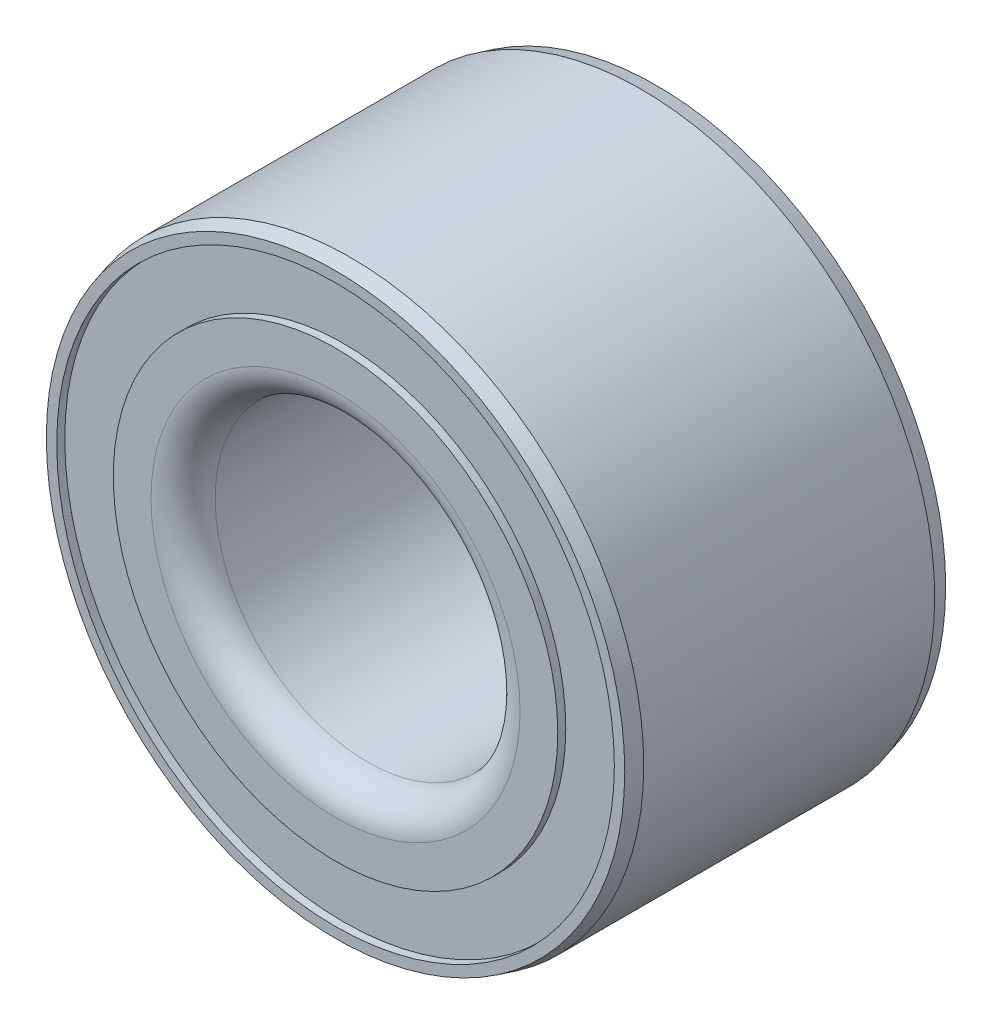
ISO-10303-21;
HEADER;
FILE_DESCRIPTION(('STEP AP214'),'2;1');
FILE_NAME('part.step','',(''),(''),'','','');
FILE_SCHEMA(('AUTOMOTIVE_DESIGN { 1 0 10303 214 1 1 1 1 }'));
ENDSEC;
DATA;
#1=APPLICATION_CONTEXT('core data for automotive mechanical design processes');
#2=APPLICATION_PROTOCOL_DEFINITION('international standard','automotive_design',2000,#1);
#3=PRODUCT_CONTEXT('',#1,'mechanical');
#4=PRODUCT('Part','Part','',(#3));
#5=PRODUCT_RELATED_PRODUCT_CATEGORY('part','',(#4));
#6=PRODUCT_DEFINITION_FORMATION('','',#4);
#7=PRODUCT_DEFINITION_CONTEXT('part definition',#1,'design');
#8=PRODUCT_DEFINITION('design','',#6,#7);
#9=PRODUCT_DEFINITION_SHAPE('','',#8);
#10=(LENGTH_UNIT() NAMED_UNIT(*) SI_UNIT(.MILLI.,.METRE.));
#11=(NAMED_UNIT(*) PLANE_ANGLE_UNIT() SI_UNIT($,.RADIAN.));
#12=(NAMED_UNIT(*) SI_UNIT($,.STERADIAN.) SOLID_ANGLE_UNIT());
#13=UNCERTAINTY_MEASURE_WITH_UNIT(LENGTH_MEASURE(1.E-05),#10,'distance_accuracy_value','');
#14=(GEOMETRIC_REPRESENTATION_CONTEXT(3) GLOBAL_UNCERTAINTY_ASSIGNED_CONTEXT((#13)) GLOBAL_UNIT_ASSIGNED_CONTEXT((#10,
#11,#12)) REPRESENTATION_CONTEXT('',''));
#15=CARTESIAN_POINT('',(0.,0.,0.));
#16=DIRECTION('',(0.,0.,1.));
#17=DIRECTION('',(1.,0.,0.));
#18=AXIS2_PLACEMENT_3D('',#15,#16,#17);
#19=CARTESIAN_POINT('',(0.,0.,0.));
#20=DIRECTION('',(0.,0.,1.));
#21=DIRECTION('',(1.,0.,0.));
#22=AXIS2_PLACEMENT_3D('',#19,#20,#21);
#23=PLANE('',#22);
#24=CARTESIAN_POINT('',(0.,0.,0.));
#25=DIRECTION('',(0.,0.,1.));
#26=DIRECTION('',(1.,0.,0.));
#27=AXIS2_PLACEMENT_3D('',#24,#25,#26);
#28=CIRCLE('',#27,23.);
#29=CARTESIAN_POINT('',(23.,0.,0.));
#30=VERTEX_POINT('',#29);
#31=EDGE_CURVE('E61',#30,#30,#28,.T.);
#32=ORIENTED_EDGE('',*,*,#31,.T.);
#33=EDGE_LOOP('',(#32));
#34=FACE_BOUND('',#33,.T.);
#35=CARTESIAN_POINT('',(0.,0.,0.));
#36=DIRECTION('',(0.,0.,-1.));
#37=DIRECTION('',(-1.,0.,0.));
#38=AXIS2_PLACEMENT_3D('',#35,#36,#37);
#39=CIRCLE('',#38,27.7);
#40=CARTESIAN_POINT('',(-27.7,0.,0.));
#41=VERTEX_POINT('',#40);
#42=EDGE_CURVE('E92',#41,#41,#39,.T.);
#43=ORIENTED_EDGE('',*,*,#42,.T.);
#44=EDGE_LOOP('',(#43));
#45=FACE_BOUND('',#44,.T.);
#46=ADVANCED_FACE('F41',(#34,#45),#23,.F.);
#47=CARTESIAN_POINT('',(0.,0.,39.9999999999996));
#48=DIRECTION('',(0.,0.,1.));
#49=DIRECTION('',(1.,0.,0.));
#50=AXIS2_PLACEMENT_3D('',#47,#48,#49);
#51=PLANE('',#50);
#52=CARTESIAN_POINT('',(0.,0.,39.9999999999996));
#53=DIRECTION('',(0.,0.,1.));
#54=DIRECTION('',(1.,0.,0.));
#55=AXIS2_PLACEMENT_3D('',#52,#53,#54);
#56=CIRCLE('',#55,23.);
#57=CARTESIAN_POINT('',(23.0000000000001,0.,39.9999999999996));
#58=VERTEX_POINT('',#57);
#59=EDGE_CURVE('E64',#58,#58,#56,.F.);
#60=ORIENTED_EDGE('',*,*,#59,.T.);
#61=EDGE_LOOP('',(#60));
#62=FACE_BOUND('',#61,.T.);
#63=CARTESIAN_POINT('',(0.,0.,39.9999999999996));
#64=DIRECTION('',(0.,0.,1.));
#65=DIRECTION('',(1.,0.,0.));
#66=AXIS2_PLACEMENT_3D('',#63,#64,#65);
#67=CIRCLE('',#66,27.7);
#68=CARTESIAN_POINT('',(27.7000000000001,0.,39.9999999999996));
#69=VERTEX_POINT('',#68);
#70=EDGE_CURVE('E80',#69,#69,#67,.T.);
#71=ORIENTED_EDGE('',*,*,#70,.T.);
#72=EDGE_LOOP('',(#71));
#73=FACE_BOUND('',#72,.T.);
#74=ADVANCED_FACE('F125',(#62,#73),#51,.T.);
#75=CARTESIAN_POINT('',(0.,0.,39.9999999999996));
#76=DIRECTION('',(0.,0.,1.));
#77=DIRECTION('',(1.,0.,0.));
#78=AXIS2_PLACEMENT_3D('',#75,#76,#77);
#79=CIRCLE('',#78,36.05);
#80=CARTESIAN_POINT('',(36.0500000000001,0.,39.9999999999996));
#81=VERTEX_POINT('',#80);
#82=EDGE_CURVE('E56',#81,#81,#79,.T.);
#83=ORIENTED_EDGE('',*,*,#82,.T.);
#84=EDGE_LOOP('',(#83));
#85=FACE_BOUND('',#84,.T.);
#86=CARTESIAN_POINT('',(0.,0.,39.9999999999996));
#87=DIRECTION('',(0.,0.,1.));
#88=DIRECTION('',(1.,0.,0.));
#89=AXIS2_PLACEMENT_3D('',#86,#87,#88);
#90=CIRCLE('',#89,34.75);
#91=CARTESIAN_POINT('',(34.7500000000001,0.,39.9999999999996));
#92=VERTEX_POINT('',#91);
#93=EDGE_CURVE('E74',#92,#92,#90,.T.);
#94=ORIENTED_EDGE('',*,*,#93,.F.);
#95=EDGE_LOOP('',(#94));
#96=FACE_BOUND('',#95,.T.);
#97=ADVANCED_FACE('F117',(#85,#96),#51,.T.);
#98=CARTESIAN_POINT('',(0.,0.,0.));
#99=DIRECTION('',(0.,0.,1.));
#100=DIRECTION('',(1.,0.,0.));
#101=AXIS2_PLACEMENT_3D('',#98,#99,#100);
#102=CIRCLE('',#101,36.05);
#103=CARTESIAN_POINT('',(36.05,0.,0.));
#104=VERTEX_POINT('',#103);
#105=EDGE_CURVE('E10',#104,#104,#102,.F.);
#106=ORIENTED_EDGE('',*,*,#105,.T.);
#107=EDGE_LOOP('',(#106));
#108=FACE_BOUND('',#107,.T.);
#109=CARTESIAN_POINT('',(0.,0.,0.));
#110=DIRECTION('',(0.,0.,-1.));
#111=DIRECTION('',(-1.,0.,0.));
#112=AXIS2_PLACEMENT_3D('',#109,#110,#111);
#113=CIRCLE('',#112,34.75);
#114=CARTESIAN_POINT('',(-34.7500000000001,0.,0.));
#115=VERTEX_POINT('',#114);
#116=EDGE_CURVE('E86',#115,#115,#113,.T.);
#117=ORIENTED_EDGE('',*,*,#116,.F.);
#118=EDGE_LOOP('',(#117));
#119=FACE_BOUND('',#118,.T.);
#120=ADVANCED_FACE('F114',(#108,#119),#23,.F.);
#121=CARTESIAN_POINT('',(0.,0.,39.9999999999996));
#122=DIRECTION('',(0.,0.,-1.));
#123=DIRECTION('',(-1.,0.,0.));
#124=AXIS2_PLACEMENT_3D('',#121,#122,#123);
#125=CYLINDRICAL_SURFACE('',#124,36.55);
#126=CARTESIAN_POINT('',(0.,0.,38.1339745962155));
#127=DIRECTION('',(0.,0.,1.));
#128=DIRECTION('',(1.,0.,0.));
#129=AXIS2_PLACEMENT_3D('',#126,#127,#128);
#130=CIRCLE('',#129,36.55);
#131=CARTESIAN_POINT('',(36.55,0.,38.1339745962155));
#132=VERTEX_POINT('',#131);
#133=EDGE_CURVE('E48',#132,#132,#130,.F.);
#134=ORIENTED_EDGE('',*,*,#133,.T.);
#135=EDGE_LOOP('',(#134));
#136=FACE_BOUND('',#135,.T.);
#137=CARTESIAN_POINT('',(1.11022302462516E-13,0.,1.86602540378444));
#138=DIRECTION('',(0.,0.,1.));
#139=DIRECTION('',(1.,0.,0.));
#140=AXIS2_PLACEMENT_3D('',#137,#138,#139);
#141=CIRCLE('',#140,36.55);
#142=CARTESIAN_POINT('',(36.5500000000002,0.,1.86602540378443));
#143=VERTEX_POINT('',#142);
#144=EDGE_CURVE('E52',#143,#143,#141,.T.);
#145=ORIENTED_EDGE('',*,*,#144,.T.);
#146=EDGE_LOOP('',(#145));
#147=FACE_BOUND('',#146,.T.);
#148=ADVANCED_FACE('F116',(#136,#147),#125,.T.);
#149=CARTESIAN_POINT('',(0.,0.,39.9999999999996));
#150=DIRECTION('',(0.,0.,-1.));
#151=DIRECTION('',(-1.,0.,0.));
#152=AXIS2_PLACEMENT_3D('',#149,#150,#151);
#153=CYLINDRICAL_SURFACE('',#152,19.);
#154=CARTESIAN_POINT('',(2.4980018054066E-13,0.,35.9999999999994));
#155=DIRECTION('',(0.,0.,1.));
#156=DIRECTION('',(1.,0.,0.));
#157=AXIS2_PLACEMENT_3D('',#154,#155,#156);
#158=CIRCLE('',#157,19.);
#159=CARTESIAN_POINT('',(19.0000000000003,0.,35.9999999999994));
#160=VERTEX_POINT('',#159);
#161=EDGE_CURVE('E67',#160,#160,#158,.T.);
#162=ORIENTED_EDGE('',*,*,#161,.T.);
#163=EDGE_LOOP('',(#162));
#164=FACE_BOUND('',#163,.T.);
#165=CARTESIAN_POINT('',(0.,0.,3.99999999999945));
#166=DIRECTION('',(0.,0.,1.));
#167=DIRECTION('',(1.,0.,0.));
#168=AXIS2_PLACEMENT_3D('',#165,#166,#167);
#169=CIRCLE('',#168,19.);
#170=CARTESIAN_POINT('',(19.,0.,3.99999999999944));
#171=VERTEX_POINT('',#170);
#172=EDGE_CURVE('E70',#171,#171,#169,.F.);
#173=ORIENTED_EDGE('',*,*,#172,.T.);
#174=EDGE_LOOP('',(#173));
#175=FACE_BOUND('',#174,.T.);
#176=ADVANCED_FACE('F123',(#164,#175),#153,.F.);
#177=CARTESIAN_POINT('',(0.,0.,38.9999999999998));
#178=DIRECTION('',(0.,0.,1.));
#179=DIRECTION('',(1.,0.,0.));
#180=AXIS2_PLACEMENT_3D('',#177,#178,#179);
#181=CYLINDRICAL_SURFACE('',#180,34.75);
#182=CARTESIAN_POINT('',(0.,0.,38.9999999999998));
#183=DIRECTION('',(0.,0.,1.));
#184=DIRECTION('',(1.,0.,0.));
#185=AXIS2_PLACEMENT_3D('',#182,#183,#184);
#186=CIRCLE('',#185,34.75);
#187=CARTESIAN_POINT('',(34.7500000000001,0.,38.9999999999998));
#188=VERTEX_POINT('',#187);
#189=EDGE_CURVE('E73',#188,#188,#186,.T.);
#190=ORIENTED_EDGE('',*,*,#189,.F.);
#191=EDGE_LOOP('',(#190));
#192=FACE_BOUND('',#191,.T.);
#193=ORIENTED_EDGE('',*,*,#93,.T.);
#194=EDGE_LOOP('',(#193));
#195=FACE_BOUND('',#194,.T.);
#196=ADVANCED_FACE('F153',(#192,#195),#181,.F.);
#197=CARTESIAN_POINT('',(0.,0.,38.9999999999998));
#198=DIRECTION('',(0.,0.,1.));
#199=DIRECTION('',(1.,0.,0.));
#200=AXIS2_PLACEMENT_3D('',#197,#198,#199);
#201=PLANE('',#200);
#202=CARTESIAN_POINT('',(0.,0.,38.9999999999998));
#203=DIRECTION('',(0.,0.,1.));
#204=DIRECTION('',(1.,0.,0.));
#205=AXIS2_PLACEMENT_3D('',#202,#203,#204);
#206=CIRCLE('',#205,27.7);
#207=CARTESIAN_POINT('',(27.7,0.,38.9999999999998));
#208=VERTEX_POINT('',#207);
#209=EDGE_CURVE('E77',#208,#208,#206,.T.);
#210=ORIENTED_EDGE('',*,*,#209,.F.);
#211=EDGE_LOOP('',(#210));
#212=FACE_BOUND('',#211,.T.);
#213=ORIENTED_EDGE('',*,*,#189,.T.);
#214=EDGE_LOOP('',(#213));
#215=FACE_BOUND('',#214,.T.);
#216=ADVANCED_FACE('F149',(#212,#215),#201,.T.);
#217=CARTESIAN_POINT('',(0.,0.,38.9999999999998));
#218=DIRECTION('',(0.,0.,1.));
#219=DIRECTION('',(1.,0.,0.));
#220=AXIS2_PLACEMENT_3D('',#217,#218,#219);
#221=CYLINDRICAL_SURFACE('',#220,27.7);
#222=ORIENTED_EDGE('',*,*,#209,.T.);
#223=EDGE_LOOP('',(#222));
#224=FACE_BOUND('',#223,.T.);
#225=ORIENTED_EDGE('',*,*,#70,.F.);
#226=EDGE_LOOP('',(#225));
#227=FACE_BOUND('',#226,.T.);
#228=ADVANCED_FACE('F110',(#224,#227),#221,.T.);
#229=CARTESIAN_POINT('',(-1.11022302462516E-13,1.38777878078145E-13,0.999999999999557));
#230=DIRECTION('',(0.,0.,-1.));
#231=DIRECTION('',(-1.,0.,0.));
#232=AXIS2_PLACEMENT_3D('',#229,#230,#231);
#233=CYLINDRICAL_SURFACE('',#232,34.75);
#234=CARTESIAN_POINT('',(-1.11022302462516E-13,1.38777878078145E-13,0.999999999999557));
#235=DIRECTION('',(0.,0.,-1.));
#236=DIRECTION('',(-1.,0.,0.));
#237=AXIS2_PLACEMENT_3D('',#234,#235,#236);
#238=CIRCLE('',#237,34.75);
#239=CARTESIAN_POINT('',(-34.7500000000002,1.44564915594003E-13,0.999999999999568));
#240=VERTEX_POINT('',#239);
#241=EDGE_CURVE('E83',#240,#240,#238,.T.);
#242=ORIENTED_EDGE('',*,*,#241,.F.);
#243=EDGE_LOOP('',(#242));
#244=FACE_BOUND('',#243,.T.);
#245=ORIENTED_EDGE('',*,*,#116,.T.);
#246=EDGE_LOOP('',(#245));
#247=FACE_BOUND('',#246,.T.);
#248=ADVANCED_FACE('F104',(#244,#247),#233,.F.);
#249=CARTESIAN_POINT('',(-1.11022302462516E-13,1.38777878078145E-13,0.999999999999557));
#250=DIRECTION('',(0.,0.,-1.));
#251=DIRECTION('',(-1.,0.,0.));
#252=AXIS2_PLACEMENT_3D('',#249,#250,#251);
#253=PLANE('',#252);
#254=CARTESIAN_POINT('',(-1.11022302462516E-13,1.38777878078145E-13,0.999999999999557));
#255=DIRECTION('',(0.,0.,-1.));
#256=DIRECTION('',(-1.,0.,0.));
#257=AXIS2_PLACEMENT_3D('',#254,#255,#256);
#258=CIRCLE('',#257,27.7);
#259=CARTESIAN_POINT('',(-27.7000000000002,1.43390854745462E-13,0.999999999999566));
#260=VERTEX_POINT('',#259);
#261=EDGE_CURVE('E89',#260,#260,#258,.T.);
#262=ORIENTED_EDGE('',*,*,#261,.F.);
#263=EDGE_LOOP('',(#262));
#264=FACE_BOUND('',#263,.T.);
#265=ORIENTED_EDGE('',*,*,#241,.T.);
#266=EDGE_LOOP('',(#265));
#267=FACE_BOUND('',#266,.T.);
#268=ADVANCED_FACE('F101',(#264,#267),#253,.T.);
#269=CARTESIAN_POINT('',(-1.11022302462516E-13,1.38777878078145E-13,0.999999999999557));
#270=DIRECTION('',(0.,0.,-1.));
#271=DIRECTION('',(-1.,0.,0.));
#272=AXIS2_PLACEMENT_3D('',#269,#270,#271);
#273=CYLINDRICAL_SURFACE('',#272,27.7);
#274=ORIENTED_EDGE('',*,*,#261,.T.);
#275=EDGE_LOOP('',(#274));
#276=FACE_BOUND('',#275,.T.);
#277=ORIENTED_EDGE('',*,*,#42,.F.);
#278=EDGE_LOOP('',(#277));
#279=FACE_BOUND('',#278,.T.);
#280=ADVANCED_FACE('F98',(#276,#279),#273,.T.);
#281=CARTESIAN_POINT('',(2.4980018054066E-13,0.,35.9999999999994));
#282=DIRECTION('',(0.,0.,1.));
#283=DIRECTION('',(1.,0.,0.));
#284=AXIS2_PLACEMENT_3D('',#281,#282,#283);
#285=TOROIDAL_SURFACE('',#284,23.,4.);
#286=ORIENTED_EDGE('',*,*,#59,.F.);
#287=EDGE_LOOP('',(#286));
#288=FACE_BOUND('',#287,.T.);
#289=ORIENTED_EDGE('',*,*,#161,.F.);
#290=EDGE_LOOP('',(#289));
#291=FACE_BOUND('',#290,.T.);
#292=ADVANCED_FACE('F138',(#288,#291),#285,.T.);
#293=CARTESIAN_POINT('',(0.,0.,3.99999999999945));
#294=DIRECTION('',(0.,0.,1.));
#295=DIRECTION('',(1.,0.,0.));
#296=AXIS2_PLACEMENT_3D('',#293,#294,#295);
#297=TOROIDAL_SURFACE('',#296,23.,4.);
#298=ORIENTED_EDGE('',*,*,#172,.F.);
#299=EDGE_LOOP('',(#298));
#300=FACE_BOUND('',#299,.T.);
#301=ORIENTED_EDGE('',*,*,#31,.F.);
#302=EDGE_LOOP('',(#301));
#303=FACE_BOUND('',#302,.T.);
#304=ADVANCED_FACE('F143',(#300,#303),#297,.T.);
#305=CARTESIAN_POINT('',(0.,0.,39.9999999999996));
#306=DIRECTION('',(0.,0.,-1.));
#307=DIRECTION('',(-1.,0.,0.));
#308=AXIS2_PLACEMENT_3D('',#305,#306,#307);
#309=CONICAL_SURFACE('',#308,36.05,0.261799387799149);
#310=ORIENTED_EDGE('',*,*,#133,.F.);
#311=EDGE_LOOP('',(#310));
#312=FACE_BOUND('',#311,.T.);
#313=ORIENTED_EDGE('',*,*,#82,.F.);
#314=EDGE_LOOP('',(#313));
#315=FACE_BOUND('',#314,.T.);
#316=ADVANCED_FACE('F167',(#312,#315),#309,.T.);
#317=CARTESIAN_POINT('',(1.11022302462516E-13,0.,1.86602540378444));
#318=DIRECTION('',(0.,0.,1.));
#319=DIRECTION('',(1.,0.,0.));
#320=AXIS2_PLACEMENT_3D('',#317,#318,#319);
#321=CONICAL_SURFACE('',#320,36.55,0.261799387799152);
#322=ORIENTED_EDGE('',*,*,#105,.F.);
#323=EDGE_LOOP('',(#322));
#324=FACE_BOUND('',#323,.T.);
#325=ORIENTED_EDGE('',*,*,#144,.F.);
#326=EDGE_LOOP('',(#325));
#327=FACE_BOUND('',#326,.T.);
#328=ADVANCED_FACE('F43',(#324,#327),#321,.T.);
#329=CLOSED_SHELL('',(#46,#74,#97,#120,#148,#176,#196,#216,#228,#248,#268,#280,#292,#304,#316,#328));
#330=MANIFOLD_SOLID_BREP('B2',#329);
#331=ADVANCED_BREP_SHAPE_REPRESENTATION('',(#18,#330),#14);
#332=SHAPE_DEFINITION_REPRESENTATION(#9,#331);
ENDSEC;
END-ISO-10303-21;
